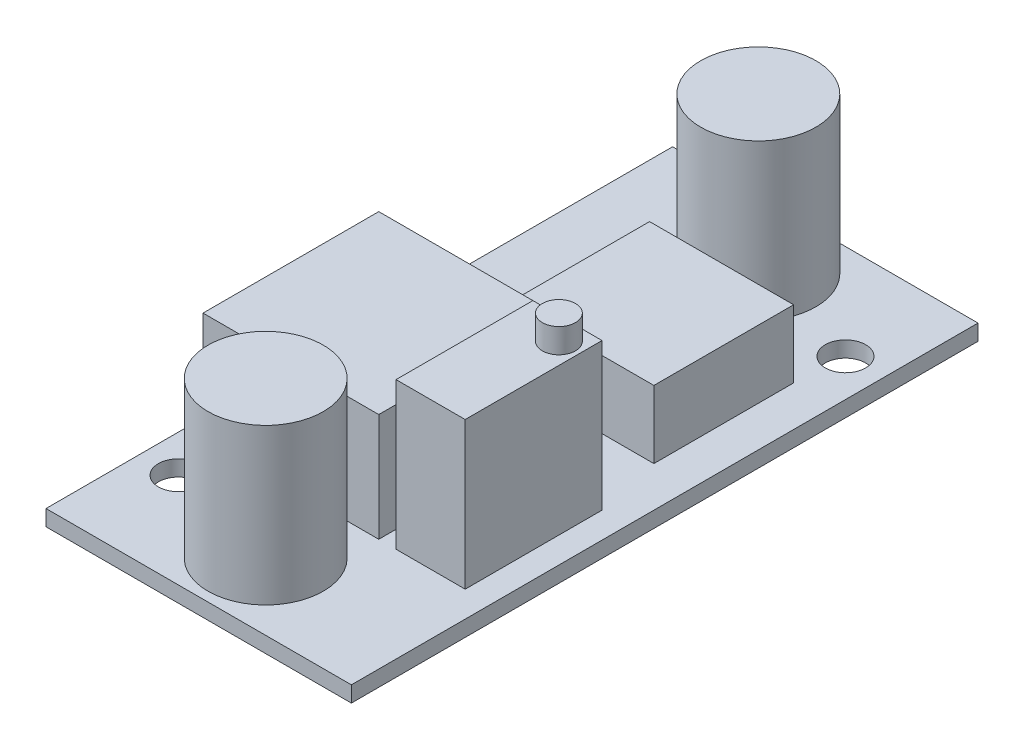
ISO-10303-21;
HEADER;
FILE_DESCRIPTION(('STEP AP214'),'2;1');
FILE_NAME('part.step','',(''),(''),'','','');
FILE_SCHEMA(('AUTOMOTIVE_DESIGN { 1 0 10303 214 1 1 1 1 }'));
ENDSEC;
DATA;
#1=APPLICATION_CONTEXT('core data for automotive mechanical design processes');
#2=APPLICATION_PROTOCOL_DEFINITION('international standard','automotive_design',2000,#1);
#3=PRODUCT_CONTEXT('',#1,'mechanical');
#4=PRODUCT('Part','Part','',(#3));
#5=PRODUCT_RELATED_PRODUCT_CATEGORY('part','',(#4));
#6=PRODUCT_DEFINITION_FORMATION('','',#4);
#7=PRODUCT_DEFINITION_CONTEXT('part definition',#1,'design');
#8=PRODUCT_DEFINITION('design','',#6,#7);
#9=PRODUCT_DEFINITION_SHAPE('','',#8);
#10=(LENGTH_UNIT() NAMED_UNIT(*) SI_UNIT(.MILLI.,.METRE.));
#11=(NAMED_UNIT(*) PLANE_ANGLE_UNIT() SI_UNIT($,.RADIAN.));
#12=(NAMED_UNIT(*) SI_UNIT($,.STERADIAN.) SOLID_ANGLE_UNIT());
#13=UNCERTAINTY_MEASURE_WITH_UNIT(LENGTH_MEASURE(1.E-05),#10,'distance_accuracy_value','');
#14=(GEOMETRIC_REPRESENTATION_CONTEXT(3) GLOBAL_UNCERTAINTY_ASSIGNED_CONTEXT((#13)) GLOBAL_UNIT_ASSIGNED_CONTEXT((#10,
#11,#12)) REPRESENTATION_CONTEXT('',''));
#15=CARTESIAN_POINT('',(0.,0.,0.));
#16=DIRECTION('',(0.,0.,1.));
#17=DIRECTION('',(1.,0.,0.));
#18=AXIS2_PLACEMENT_3D('',#15,#16,#17);
#19=CARTESIAN_POINT('',(0.,1.1,0.));
#20=DIRECTION('',(0.,1.,0.));
#21=DIRECTION('',(0.,0.,1.));
#22=AXIS2_PLACEMENT_3D('',#19,#20,#21);
#23=PLANE('',#22);
#24=CARTESIAN_POINT('',(-1.96202853894965E-12,1.1,17.1));
#25=DIRECTION('',(0.,1.,0.));
#26=DIRECTION('',(0.,0.,1.));
#27=AXIS2_PLACEMENT_3D('',#24,#25,#26);
#28=CIRCLE('',#27,4.);
#29=CARTESIAN_POINT('',(-1.96202853894965E-12,1.1,21.1));
#30=VERTEX_POINT('',#29);
#31=EDGE_CURVE('E234',#30,#30,#28,.T.);
#32=ORIENTED_EDGE('',*,*,#31,.F.);
#33=EDGE_LOOP('',(#32));
#34=FACE_BOUND('',#33,.T.);
#35=CARTESIAN_POINT('',(0.,1.1,-17.1));
#36=DIRECTION('',(0.,1.,0.));
#37=DIRECTION('',(0.,0.,1.));
#38=AXIS2_PLACEMENT_3D('',#35,#36,#37);
#39=CIRCLE('',#38,4.);
#40=CARTESIAN_POINT('',(0.,1.1,-13.1));
#41=VERTEX_POINT('',#40);
#42=EDGE_CURVE('E238',#41,#41,#39,.T.);
#43=ORIENTED_EDGE('',*,*,#42,.F.);
#44=EDGE_LOOP('',(#43));
#45=FACE_BOUND('',#44,.T.);
#46=CARTESIAN_POINT('',(8.,1.1,-15.15));
#47=DIRECTION('',(0.,1.,0.));
#48=DIRECTION('',(0.,0.,1.));
#49=AXIS2_PLACEMENT_3D('',#46,#47,#48);
#50=CIRCLE('',#49,1.4);
#51=CARTESIAN_POINT('',(8.,1.1,-13.75));
#52=VERTEX_POINT('',#51);
#53=EDGE_CURVE('E253',#52,#52,#50,.T.);
#54=ORIENTED_EDGE('',*,*,#53,.F.);
#55=EDGE_LOOP('',(#54));
#56=FACE_BOUND('',#55,.T.);
#57=DIRECTION('',(0.,0.,1.));
#58=VECTOR('',#57,1.);
#59=CARTESIAN_POINT('',(-10.6,1.1,21.75));
#60=LINE('',#59,#58);
#61=CARTESIAN_POINT('',(-10.6,1.1,-21.75));
#62=VERTEX_POINT('',#61);
#63=CARTESIAN_POINT('',(-10.6,1.1,21.75));
#64=VERTEX_POINT('',#63);
#65=EDGE_CURVE('E259',#62,#64,#60,.T.);
#66=ORIENTED_EDGE('',*,*,#65,.T.);
#67=DIRECTION('',(1.,0.,0.));
#68=VECTOR('',#67,1.);
#69=CARTESIAN_POINT('',(10.6,1.1,21.75));
#70=LINE('',#69,#68);
#71=CARTESIAN_POINT('',(10.6,1.1,21.75));
#72=VERTEX_POINT('',#71);
#73=EDGE_CURVE('E262',#64,#72,#70,.T.);
#74=ORIENTED_EDGE('',*,*,#73,.T.);
#75=DIRECTION('',(0.,0.,-1.));
#76=VECTOR('',#75,1.);
#77=CARTESIAN_POINT('',(10.6,1.1,21.75));
#78=LINE('',#77,#76);
#79=CARTESIAN_POINT('',(10.6,1.1,-21.75));
#80=VERTEX_POINT('',#79);
#81=EDGE_CURVE('E265',#72,#80,#78,.T.);
#82=ORIENTED_EDGE('',*,*,#81,.T.);
#83=DIRECTION('',(-1.,0.,0.));
#84=VECTOR('',#83,1.);
#85=CARTESIAN_POINT('',(10.6,1.1,-21.75));
#86=LINE('',#85,#84);
#87=EDGE_CURVE('E267',#80,#62,#86,.T.);
#88=ORIENTED_EDGE('',*,*,#87,.T.);
#89=EDGE_LOOP('',(#66,#74,#82,#88));
#90=FACE_BOUND('',#89,.T.);
#91=CARTESIAN_POINT('',(-8.0000000000001,1.1,15.1499999999999));
#92=DIRECTION('',(0.,1.,0.));
#93=DIRECTION('',(0.,0.,1.));
#94=AXIS2_PLACEMENT_3D('',#91,#92,#93);
#95=CIRCLE('',#94,1.4);
#96=CARTESIAN_POINT('',(-8.0000000000001,1.1,16.5499999999999));
#97=VERTEX_POINT('',#96);
#98=EDGE_CURVE('E247',#97,#97,#95,.T.);
#99=ORIENTED_EDGE('',*,*,#98,.F.);
#100=EDGE_LOOP('',(#99));
#101=FACE_BOUND('',#100,.T.);
#102=DIRECTION('',(-1.,0.,0.));
#103=VECTOR('',#102,1.);
#104=CARTESIAN_POINT('',(-9.4,1.1,-0.149999999999989));
#105=LINE('',#104,#103);
#106=CARTESIAN_POINT('',(2.8,1.1,-0.149999999999989));
#107=VERTEX_POINT('',#106);
#108=CARTESIAN_POINT('',(-9.4,1.1,-0.149999999999989));
#109=VERTEX_POINT('',#108);
#110=EDGE_CURVE('E219',#107,#109,#105,.T.);
#111=ORIENTED_EDGE('',*,*,#110,.F.);
#112=DIRECTION('',(0.,0.,-1.));
#113=VECTOR('',#112,1.);
#114=CARTESIAN_POINT('',(2.8,1.1,12.05));
#115=LINE('',#114,#113);
#116=CARTESIAN_POINT('',(2.8,1.1,12.05));
#117=VERTEX_POINT('',#116);
#118=EDGE_CURVE('E205',#117,#107,#115,.T.);
#119=ORIENTED_EDGE('',*,*,#118,.F.);
#120=DIRECTION('',(1.,0.,0.));
#121=VECTOR('',#120,1.);
#122=CARTESIAN_POINT('',(-9.4,1.1,12.05));
#123=LINE('',#122,#121);
#124=CARTESIAN_POINT('',(-9.4,1.1,12.05));
#125=VERTEX_POINT('',#124);
#126=EDGE_CURVE('E210',#125,#117,#123,.T.);
#127=ORIENTED_EDGE('',*,*,#126,.F.);
#128=DIRECTION('',(0.,0.,1.));
#129=VECTOR('',#128,1.);
#130=CARTESIAN_POINT('',(-9.4,1.1,12.05));
#131=LINE('',#130,#129);
#132=EDGE_CURVE('E221',#109,#125,#131,.T.);
#133=ORIENTED_EDGE('',*,*,#132,.F.);
#134=EDGE_LOOP('',(#111,#119,#127,#133));
#135=FACE_BOUND('',#134,.T.);
#136=DIRECTION('',(1.,0.,0.));
#137=VECTOR('',#136,1.);
#138=CARTESIAN_POINT('',(8.8,1.1,12.05));
#139=LINE('',#138,#137);
#140=CARTESIAN_POINT('',(4.00000000000001,1.1,12.05));
#141=VERTEX_POINT('',#140);
#142=CARTESIAN_POINT('',(8.8,1.1,12.05));
#143=VERTEX_POINT('',#142);
#144=EDGE_CURVE('E177',#141,#143,#139,.T.);
#145=ORIENTED_EDGE('',*,*,#144,.F.);
#146=DIRECTION('',(0.,0.,1.));
#147=VECTOR('',#146,1.);
#148=CARTESIAN_POINT('',(4.,1.1,2.55000000000001));
#149=LINE('',#148,#147);
#150=CARTESIAN_POINT('',(4.,1.1,2.55000000000001));
#151=VERTEX_POINT('',#150);
#152=EDGE_CURVE('E174',#151,#141,#149,.T.);
#153=ORIENTED_EDGE('',*,*,#152,.F.);
#154=DIRECTION('',(-1.,0.,0.));
#155=VECTOR('',#154,1.);
#156=CARTESIAN_POINT('',(8.8,1.1,2.55000000000001));
#157=LINE('',#156,#155);
#158=CARTESIAN_POINT('',(8.8,1.1,2.55000000000001));
#159=VERTEX_POINT('',#158);
#160=EDGE_CURVE('E186',#159,#151,#157,.T.);
#161=ORIENTED_EDGE('',*,*,#160,.F.);
#162=DIRECTION('',(0.,0.,-1.));
#163=VECTOR('',#162,1.);
#164=CARTESIAN_POINT('',(8.8,1.1,2.55000000000001));
#165=LINE('',#164,#163);
#166=EDGE_CURVE('E194',#143,#159,#165,.T.);
#167=ORIENTED_EDGE('',*,*,#166,.F.);
#168=EDGE_LOOP('',(#145,#153,#161,#167));
#169=FACE_BOUND('',#168,.T.);
#170=DIRECTION('',(-1.,0.,0.));
#171=VECTOR('',#170,1.);
#172=CARTESIAN_POINT('',(-2.2,1.1,-11.75));
#173=LINE('',#172,#171);
#174=CARTESIAN_POINT('',(7.8,1.1,-11.75));
#175=VERTEX_POINT('',#174);
#176=CARTESIAN_POINT('',(-2.2,1.1,-11.75));
#177=VERTEX_POINT('',#176);
#178=EDGE_CURVE('E321',#175,#177,#173,.T.);
#179=ORIENTED_EDGE('',*,*,#178,.F.);
#180=DIRECTION('',(0.,0.,-1.));
#181=VECTOR('',#180,1.);
#182=CARTESIAN_POINT('',(7.8,1.1,-11.75));
#183=LINE('',#182,#181);
#184=CARTESIAN_POINT('',(7.8,1.1,-2.04999999999999));
#185=VERTEX_POINT('',#184);
#186=EDGE_CURVE('E172',#185,#175,#183,.T.);
#187=ORIENTED_EDGE('',*,*,#186,.F.);
#188=DIRECTION('',(1.,0.,0.));
#189=VECTOR('',#188,1.);
#190=CARTESIAN_POINT('',(-2.2,1.1,-2.04999999999999));
#191=LINE('',#190,#189);
#192=CARTESIAN_POINT('',(-2.2,1.1,-2.04999999999999));
#193=VERTEX_POINT('',#192);
#194=EDGE_CURVE('E168',#193,#185,#191,.T.);
#195=ORIENTED_EDGE('',*,*,#194,.F.);
#196=DIRECTION('',(0.,0.,1.));
#197=VECTOR('',#196,1.);
#198=CARTESIAN_POINT('',(-2.2,1.1,-11.75));
#199=LINE('',#198,#197);
#200=EDGE_CURVE('E323',#177,#193,#199,.T.);
#201=ORIENTED_EDGE('',*,*,#200,.F.);
#202=EDGE_LOOP('',(#179,#187,#195,#201));
#203=FACE_BOUND('',#202,.T.);
#204=ADVANCED_FACE('F35',(#34,#45,#56,#90,#101,#135,#169,#203),#23,.T.);
#205=CARTESIAN_POINT('',(0.,0.,0.));
#206=DIRECTION('',(0.,1.,0.));
#207=DIRECTION('',(0.,0.,1.));
#208=AXIS2_PLACEMENT_3D('',#205,#206,#207);
#209=PLANE('',#208);
#210=DIRECTION('',(0.,0.,1.));
#211=VECTOR('',#210,1.);
#212=CARTESIAN_POINT('',(-10.6,0.,21.75));
#213=LINE('',#212,#211);
#214=CARTESIAN_POINT('',(-10.6,0.,-21.75));
#215=VERTEX_POINT('',#214);
#216=CARTESIAN_POINT('',(-10.6,0.,21.75));
#217=VERTEX_POINT('',#216);
#218=EDGE_CURVE('E256',#215,#217,#213,.T.);
#219=ORIENTED_EDGE('',*,*,#218,.F.);
#220=DIRECTION('',(-1.,0.,0.));
#221=VECTOR('',#220,1.);
#222=CARTESIAN_POINT('',(10.6,0.,-21.75));
#223=LINE('',#222,#221);
#224=CARTESIAN_POINT('',(10.6,0.,-21.75));
#225=VERTEX_POINT('',#224);
#226=EDGE_CURVE('E263',#225,#215,#223,.T.);
#227=ORIENTED_EDGE('',*,*,#226,.F.);
#228=DIRECTION('',(0.,0.,-1.));
#229=VECTOR('',#228,1.);
#230=CARTESIAN_POINT('',(10.6,0.,21.75));
#231=LINE('',#230,#229);
#232=CARTESIAN_POINT('',(10.6,0.,21.75));
#233=VERTEX_POINT('',#232);
#234=EDGE_CURVE('E274',#233,#225,#231,.T.);
#235=ORIENTED_EDGE('',*,*,#234,.F.);
#236=DIRECTION('',(1.,0.,0.));
#237=VECTOR('',#236,1.);
#238=CARTESIAN_POINT('',(10.6,0.,21.75));
#239=LINE('',#238,#237);
#240=EDGE_CURVE('E272',#217,#233,#239,.T.);
#241=ORIENTED_EDGE('',*,*,#240,.F.);
#242=EDGE_LOOP('',(#219,#227,#235,#241));
#243=FACE_BOUND('',#242,.T.);
#244=CARTESIAN_POINT('',(8.,0.,-15.15));
#245=DIRECTION('',(0.,1.,0.));
#246=DIRECTION('',(0.,0.,1.));
#247=AXIS2_PLACEMENT_3D('',#244,#245,#246);
#248=CIRCLE('',#247,1.4);
#249=CARTESIAN_POINT('',(8.,0.,-13.75));
#250=VERTEX_POINT('',#249);
#251=EDGE_CURVE('E250',#250,#250,#248,.T.);
#252=ORIENTED_EDGE('',*,*,#251,.T.);
#253=EDGE_LOOP('',(#252));
#254=FACE_BOUND('',#253,.T.);
#255=CARTESIAN_POINT('',(-8.0000000000001,0.,15.1499999999999));
#256=DIRECTION('',(0.,1.,0.));
#257=DIRECTION('',(0.,0.,1.));
#258=AXIS2_PLACEMENT_3D('',#255,#256,#257);
#259=CIRCLE('',#258,1.4);
#260=CARTESIAN_POINT('',(-8.0000000000001,0.,16.5499999999999));
#261=VERTEX_POINT('',#260);
#262=EDGE_CURVE('E244',#261,#261,#259,.T.);
#263=ORIENTED_EDGE('',*,*,#262,.T.);
#264=EDGE_LOOP('',(#263));
#265=FACE_BOUND('',#264,.T.);
#266=ADVANCED_FACE('F295',(#243,#254,#265),#209,.F.);
#267=CARTESIAN_POINT('',(-10.6,1.1,21.75));
#268=DIRECTION('',(1.,0.,0.));
#269=DIRECTION('',(0.,0.,-1.));
#270=AXIS2_PLACEMENT_3D('',#267,#268,#269);
#271=PLANE('',#270);
#272=ORIENTED_EDGE('',*,*,#218,.T.);
#273=DIRECTION('',(0.,-1.,0.));
#274=VECTOR('',#273,1.);
#275=CARTESIAN_POINT('',(-10.6,1.1,21.75));
#276=LINE('',#275,#274);
#277=EDGE_CURVE('E43',#64,#217,#276,.T.);
#278=ORIENTED_EDGE('',*,*,#277,.F.);
#279=ORIENTED_EDGE('',*,*,#65,.F.);
#280=DIRECTION('',(0.,-1.,0.));
#281=VECTOR('',#280,1.);
#282=CARTESIAN_POINT('',(-10.6,1.1,-21.75));
#283=LINE('',#282,#281);
#284=EDGE_CURVE('E269',#62,#215,#283,.T.);
#285=ORIENTED_EDGE('',*,*,#284,.T.);
#286=EDGE_LOOP('',(#272,#278,#279,#285));
#287=FACE_BOUND('',#286,.T.);
#288=ADVANCED_FACE('F37',(#287),#271,.F.);
#289=CARTESIAN_POINT('',(10.6,1.1,21.75));
#290=DIRECTION('',(0.,0.,-1.));
#291=DIRECTION('',(-1.,0.,0.));
#292=AXIS2_PLACEMENT_3D('',#289,#290,#291);
#293=PLANE('',#292);
#294=ORIENTED_EDGE('',*,*,#240,.T.);
#295=DIRECTION('',(0.,-1.,0.));
#296=VECTOR('',#295,1.);
#297=CARTESIAN_POINT('',(10.6,1.1,21.75));
#298=LINE('',#297,#296);
#299=EDGE_CURVE('E282',#72,#233,#298,.T.);
#300=ORIENTED_EDGE('',*,*,#299,.F.);
#301=ORIENTED_EDGE('',*,*,#73,.F.);
#302=ORIENTED_EDGE('',*,*,#277,.T.);
#303=EDGE_LOOP('',(#294,#300,#301,#302));
#304=FACE_BOUND('',#303,.T.);
#305=ADVANCED_FACE('F287',(#304),#293,.F.);
#306=CARTESIAN_POINT('',(10.6,1.1,21.75));
#307=DIRECTION('',(-1.,0.,0.));
#308=DIRECTION('',(0.,0.,1.));
#309=AXIS2_PLACEMENT_3D('',#306,#307,#308);
#310=PLANE('',#309);
#311=ORIENTED_EDGE('',*,*,#234,.T.);
#312=DIRECTION('',(0.,-1.,0.));
#313=VECTOR('',#312,1.);
#314=CARTESIAN_POINT('',(10.6,1.1,-21.75));
#315=LINE('',#314,#313);
#316=EDGE_CURVE('E279',#80,#225,#315,.T.);
#317=ORIENTED_EDGE('',*,*,#316,.F.);
#318=ORIENTED_EDGE('',*,*,#81,.F.);
#319=ORIENTED_EDGE('',*,*,#299,.T.);
#320=EDGE_LOOP('',(#311,#317,#318,#319));
#321=FACE_BOUND('',#320,.T.);
#322=ADVANCED_FACE('F300',(#321),#310,.F.);
#323=CARTESIAN_POINT('',(10.6,1.1,-21.75));
#324=DIRECTION('',(0.,0.,1.));
#325=DIRECTION('',(1.,0.,0.));
#326=AXIS2_PLACEMENT_3D('',#323,#324,#325);
#327=PLANE('',#326);
#328=ORIENTED_EDGE('',*,*,#226,.T.);
#329=ORIENTED_EDGE('',*,*,#284,.F.);
#330=ORIENTED_EDGE('',*,*,#87,.F.);
#331=ORIENTED_EDGE('',*,*,#316,.T.);
#332=EDGE_LOOP('',(#328,#329,#330,#331));
#333=FACE_BOUND('',#332,.T.);
#334=ADVANCED_FACE('F304',(#333),#327,.F.);
#335=CARTESIAN_POINT('',(8.,1.1,-15.15));
#336=DIRECTION('',(0.,-1.,0.));
#337=DIRECTION('',(0.,0.,-1.));
#338=AXIS2_PLACEMENT_3D('',#335,#336,#337);
#339=CYLINDRICAL_SURFACE('',#338,1.4);
#340=ORIENTED_EDGE('',*,*,#53,.T.);
#341=EDGE_LOOP('',(#340));
#342=FACE_BOUND('',#341,.T.);
#343=ORIENTED_EDGE('',*,*,#251,.F.);
#344=EDGE_LOOP('',(#343));
#345=FACE_BOUND('',#344,.T.);
#346=ADVANCED_FACE('F413',(#342,#345),#339,.F.);
#347=CARTESIAN_POINT('',(-8.0000000000001,1.1,15.1499999999999));
#348=DIRECTION('',(0.,-1.,0.));
#349=DIRECTION('',(0.,0.,-1.));
#350=AXIS2_PLACEMENT_3D('',#347,#348,#349);
#351=CYLINDRICAL_SURFACE('',#350,1.4);
#352=ORIENTED_EDGE('',*,*,#98,.T.);
#353=EDGE_LOOP('',(#352));
#354=FACE_BOUND('',#353,.T.);
#355=ORIENTED_EDGE('',*,*,#262,.F.);
#356=EDGE_LOOP('',(#355));
#357=FACE_BOUND('',#356,.T.);
#358=ADVANCED_FACE('F409',(#354,#357),#351,.F.);
#359=CARTESIAN_POINT('',(0.,11.9,-17.1));
#360=DIRECTION('',(0.,-1.,0.));
#361=DIRECTION('',(0.,0.,-1.));
#362=AXIS2_PLACEMENT_3D('',#359,#360,#361);
#363=CYLINDRICAL_SURFACE('',#362,4.);
#364=CARTESIAN_POINT('',(0.,11.9,-17.1));
#365=DIRECTION('',(0.,1.,0.));
#366=DIRECTION('',(0.,0.,1.));
#367=AXIS2_PLACEMENT_3D('',#364,#365,#366);
#368=CIRCLE('',#367,4.);
#369=CARTESIAN_POINT('',(0.,11.9,-13.1));
#370=VERTEX_POINT('',#369);
#371=EDGE_CURVE('E241',#370,#370,#368,.T.);
#372=ORIENTED_EDGE('',*,*,#371,.F.);
#373=EDGE_LOOP('',(#372));
#374=FACE_BOUND('',#373,.T.);
#375=ORIENTED_EDGE('',*,*,#42,.T.);
#376=EDGE_LOOP('',(#375));
#377=FACE_BOUND('',#376,.T.);
#378=ADVANCED_FACE('F405',(#374,#377),#363,.T.);
#379=CARTESIAN_POINT('',(0.,11.9,-17.1));
#380=DIRECTION('',(0.,1.,0.));
#381=DIRECTION('',(0.,0.,1.));
#382=AXIS2_PLACEMENT_3D('',#379,#380,#381);
#383=PLANE('',#382);
#384=ORIENTED_EDGE('',*,*,#371,.T.);
#385=EDGE_LOOP('',(#384));
#386=FACE_BOUND('',#385,.T.);
#387=ADVANCED_FACE('F401',(#386),#383,.T.);
#388=CARTESIAN_POINT('',(-1.96202853894965E-12,11.9,17.1));
#389=DIRECTION('',(0.,-1.,0.));
#390=DIRECTION('',(0.,0.,-1.));
#391=AXIS2_PLACEMENT_3D('',#388,#389,#390);
#392=CYLINDRICAL_SURFACE('',#391,4.);
#393=CARTESIAN_POINT('',(-1.96202853894965E-12,11.9,17.1));
#394=DIRECTION('',(0.,1.,0.));
#395=DIRECTION('',(0.,0.,1.));
#396=AXIS2_PLACEMENT_3D('',#393,#394,#395);
#397=CIRCLE('',#396,4.);
#398=CARTESIAN_POINT('',(-1.96202853894965E-12,11.9,21.1));
#399=VERTEX_POINT('',#398);
#400=EDGE_CURVE('E235',#399,#399,#397,.T.);
#401=ORIENTED_EDGE('',*,*,#400,.F.);
#402=EDGE_LOOP('',(#401));
#403=FACE_BOUND('',#402,.T.);
#404=ORIENTED_EDGE('',*,*,#31,.T.);
#405=EDGE_LOOP('',(#404));
#406=FACE_BOUND('',#405,.T.);
#407=ADVANCED_FACE('F397',(#403,#406),#392,.T.);
#408=CARTESIAN_POINT('',(-1.96202853894965E-12,11.9,17.1));
#409=DIRECTION('',(0.,1.,0.));
#410=DIRECTION('',(0.,0.,1.));
#411=AXIS2_PLACEMENT_3D('',#408,#409,#410);
#412=PLANE('',#411);
#413=ORIENTED_EDGE('',*,*,#400,.T.);
#414=EDGE_LOOP('',(#413));
#415=FACE_BOUND('',#414,.T.);
#416=ADVANCED_FACE('F393',(#415),#412,.T.);
#417=CARTESIAN_POINT('',(2.8,8.6,12.05));
#418=DIRECTION('',(-1.,0.,0.));
#419=DIRECTION('',(0.,0.,1.));
#420=AXIS2_PLACEMENT_3D('',#417,#418,#419);
#421=PLANE('',#420);
#422=ORIENTED_EDGE('',*,*,#118,.T.);
#423=DIRECTION('',(0.,-1.,0.));
#424=VECTOR('',#423,1.);
#425=CARTESIAN_POINT('',(2.8,8.6,-0.149999999999989));
#426=LINE('',#425,#424);
#427=CARTESIAN_POINT('',(2.8,8.6,-0.149999999999989));
#428=VERTEX_POINT('',#427);
#429=EDGE_CURVE('E232',#428,#107,#426,.T.);
#430=ORIENTED_EDGE('',*,*,#429,.F.);
#431=DIRECTION('',(0.,0.,-1.));
#432=VECTOR('',#431,1.);
#433=CARTESIAN_POINT('',(2.8,8.6,12.05));
#434=LINE('',#433,#432);
#435=CARTESIAN_POINT('',(2.8,8.6,12.05));
#436=VERTEX_POINT('',#435);
#437=EDGE_CURVE('E206',#436,#428,#434,.T.);
#438=ORIENTED_EDGE('',*,*,#437,.F.);
#439=DIRECTION('',(0.,-1.,0.));
#440=VECTOR('',#439,1.);
#441=CARTESIAN_POINT('',(2.8,8.6,12.05));
#442=LINE('',#441,#440);
#443=EDGE_CURVE('E216',#436,#117,#442,.T.);
#444=ORIENTED_EDGE('',*,*,#443,.T.);
#445=EDGE_LOOP('',(#422,#430,#438,#444));
#446=FACE_BOUND('',#445,.T.);
#447=ADVANCED_FACE('F389',(#446),#421,.F.);
#448=CARTESIAN_POINT('',(-9.4,8.6,-0.149999999999989));
#449=DIRECTION('',(0.,0.,1.));
#450=DIRECTION('',(1.,0.,0.));
#451=AXIS2_PLACEMENT_3D('',#448,#449,#450);
#452=PLANE('',#451);
#453=ORIENTED_EDGE('',*,*,#110,.T.);
#454=DIRECTION('',(0.,-1.,0.));
#455=VECTOR('',#454,1.);
#456=CARTESIAN_POINT('',(-9.4,8.6,-0.149999999999989));
#457=LINE('',#456,#455);
#458=CARTESIAN_POINT('',(-9.4,8.6,-0.149999999999989));
#459=VERTEX_POINT('',#458);
#460=EDGE_CURVE('E229',#459,#109,#457,.T.);
#461=ORIENTED_EDGE('',*,*,#460,.F.);
#462=DIRECTION('',(-1.,0.,0.));
#463=VECTOR('',#462,1.);
#464=CARTESIAN_POINT('',(-9.4,8.6,-0.149999999999989));
#465=LINE('',#464,#463);
#466=EDGE_CURVE('E209',#428,#459,#465,.T.);
#467=ORIENTED_EDGE('',*,*,#466,.F.);
#468=ORIENTED_EDGE('',*,*,#429,.T.);
#469=EDGE_LOOP('',(#453,#461,#467,#468));
#470=FACE_BOUND('',#469,.T.);
#471=ADVANCED_FACE('F385',(#470),#452,.F.);
#472=CARTESIAN_POINT('',(-9.4,8.6,12.05));
#473=DIRECTION('',(1.,0.,0.));
#474=DIRECTION('',(0.,0.,-1.));
#475=AXIS2_PLACEMENT_3D('',#472,#473,#474);
#476=PLANE('',#475);
#477=ORIENTED_EDGE('',*,*,#132,.T.);
#478=DIRECTION('',(0.,-1.,0.));
#479=VECTOR('',#478,1.);
#480=CARTESIAN_POINT('',(-9.4,8.6,12.05));
#481=LINE('',#480,#479);
#482=CARTESIAN_POINT('',(-9.4,8.6,12.05));
#483=VERTEX_POINT('',#482);
#484=EDGE_CURVE('E227',#483,#125,#481,.T.);
#485=ORIENTED_EDGE('',*,*,#484,.F.);
#486=DIRECTION('',(0.,0.,1.));
#487=VECTOR('',#486,1.);
#488=CARTESIAN_POINT('',(-9.4,8.6,12.05));
#489=LINE('',#488,#487);
#490=EDGE_CURVE('E212',#459,#483,#489,.T.);
#491=ORIENTED_EDGE('',*,*,#490,.F.);
#492=ORIENTED_EDGE('',*,*,#460,.T.);
#493=EDGE_LOOP('',(#477,#485,#491,#492));
#494=FACE_BOUND('',#493,.T.);
#495=ADVANCED_FACE('F381',(#494),#476,.F.);
#496=CARTESIAN_POINT('',(-9.4,8.6,12.05));
#497=DIRECTION('',(0.,0.,-1.));
#498=DIRECTION('',(-1.,0.,0.));
#499=AXIS2_PLACEMENT_3D('',#496,#497,#498);
#500=PLANE('',#499);
#501=ORIENTED_EDGE('',*,*,#126,.T.);
#502=ORIENTED_EDGE('',*,*,#443,.F.);
#503=DIRECTION('',(1.,0.,0.));
#504=VECTOR('',#503,1.);
#505=CARTESIAN_POINT('',(-9.4,8.6,12.05));
#506=LINE('',#505,#504);
#507=EDGE_CURVE('E214',#483,#436,#506,.T.);
#508=ORIENTED_EDGE('',*,*,#507,.F.);
#509=ORIENTED_EDGE('',*,*,#484,.T.);
#510=EDGE_LOOP('',(#501,#502,#508,#509));
#511=FACE_BOUND('',#510,.T.);
#512=ADVANCED_FACE('F377',(#511),#500,.F.);
#513=CARTESIAN_POINT('',(0.,8.6,0.));
#514=DIRECTION('',(0.,-1.,0.));
#515=DIRECTION('',(0.,0.,-1.));
#516=AXIS2_PLACEMENT_3D('',#513,#514,#515);
#517=PLANE('',#516);
#518=ORIENTED_EDGE('',*,*,#437,.T.);
#519=ORIENTED_EDGE('',*,*,#466,.T.);
#520=ORIENTED_EDGE('',*,*,#490,.T.);
#521=ORIENTED_EDGE('',*,*,#507,.T.);
#522=EDGE_LOOP('',(#518,#519,#520,#521));
#523=FACE_BOUND('',#522,.T.);
#524=ADVANCED_FACE('F374',(#523),#517,.F.);
#525=CARTESIAN_POINT('',(4.,11.3,2.55000000000001));
#526=DIRECTION('',(1.,0.,0.));
#527=DIRECTION('',(0.,0.,-1.));
#528=AXIS2_PLACEMENT_3D('',#525,#526,#527);
#529=PLANE('',#528);
#530=ORIENTED_EDGE('',*,*,#152,.T.);
#531=DIRECTION('',(0.,-1.,0.));
#532=VECTOR('',#531,1.);
#533=CARTESIAN_POINT('',(4.00000000000001,11.3,12.05));
#534=LINE('',#533,#532);
#535=CARTESIAN_POINT('',(4.00000000000001,11.3,12.05));
#536=VERTEX_POINT('',#535);
#537=EDGE_CURVE('E203',#536,#141,#534,.T.);
#538=ORIENTED_EDGE('',*,*,#537,.F.);
#539=DIRECTION('',(0.,0.,1.));
#540=VECTOR('',#539,1.);
#541=CARTESIAN_POINT('',(4.,11.3,2.55000000000001));
#542=LINE('',#541,#540);
#543=CARTESIAN_POINT('',(4.,11.3,2.55000000000001));
#544=VERTEX_POINT('',#543);
#545=EDGE_CURVE('E182',#544,#536,#542,.T.);
#546=ORIENTED_EDGE('',*,*,#545,.F.);
#547=DIRECTION('',(0.,-1.,0.));
#548=VECTOR('',#547,1.);
#549=CARTESIAN_POINT('',(4.,11.3,2.55000000000001));
#550=LINE('',#549,#548);
#551=EDGE_CURVE('E191',#544,#151,#550,.T.);
#552=ORIENTED_EDGE('',*,*,#551,.T.);
#553=EDGE_LOOP('',(#530,#538,#546,#552));
#554=FACE_BOUND('',#553,.T.);
#555=ADVANCED_FACE('F355',(#554),#529,.F.);
#556=CARTESIAN_POINT('',(8.8,11.3,12.05));
#557=DIRECTION('',(0.,0.,-1.));
#558=DIRECTION('',(-1.,0.,0.));
#559=AXIS2_PLACEMENT_3D('',#556,#557,#558);
#560=PLANE('',#559);
#561=ORIENTED_EDGE('',*,*,#144,.T.);
#562=DIRECTION('',(0.,-1.,0.));
#563=VECTOR('',#562,1.);
#564=CARTESIAN_POINT('',(8.8,11.3,12.05));
#565=LINE('',#564,#563);
#566=CARTESIAN_POINT('',(8.8,11.3,12.05));
#567=VERTEX_POINT('',#566);
#568=EDGE_CURVE('E200',#567,#143,#565,.T.);
#569=ORIENTED_EDGE('',*,*,#568,.F.);
#570=DIRECTION('',(1.,0.,0.));
#571=VECTOR('',#570,1.);
#572=CARTESIAN_POINT('',(8.8,11.3,12.05));
#573=LINE('',#572,#571);
#574=EDGE_CURVE('E185',#536,#567,#573,.T.);
#575=ORIENTED_EDGE('',*,*,#574,.F.);
#576=ORIENTED_EDGE('',*,*,#537,.T.);
#577=EDGE_LOOP('',(#561,#569,#575,#576));
#578=FACE_BOUND('',#577,.T.);
#579=ADVANCED_FACE('F357',(#578),#560,.F.);
#580=CARTESIAN_POINT('',(8.8,11.3,2.55000000000001));
#581=DIRECTION('',(-1.,0.,0.));
#582=DIRECTION('',(0.,0.,1.));
#583=AXIS2_PLACEMENT_3D('',#580,#581,#582);
#584=PLANE('',#583);
#585=ORIENTED_EDGE('',*,*,#166,.T.);
#586=DIRECTION('',(0.,-1.,0.));
#587=VECTOR('',#586,1.);
#588=CARTESIAN_POINT('',(8.8,11.3,2.55000000000001));
#589=LINE('',#588,#587);
#590=CARTESIAN_POINT('',(8.8,11.3,2.55000000000001));
#591=VERTEX_POINT('',#590);
#592=EDGE_CURVE('E58',#591,#159,#589,.T.);
#593=ORIENTED_EDGE('',*,*,#592,.F.);
#594=DIRECTION('',(0.,0.,-1.));
#595=VECTOR('',#594,1.);
#596=CARTESIAN_POINT('',(8.8,11.3,2.55000000000001));
#597=LINE('',#596,#595);
#598=EDGE_CURVE('E188',#567,#591,#597,.T.);
#599=ORIENTED_EDGE('',*,*,#598,.F.);
#600=ORIENTED_EDGE('',*,*,#568,.T.);
#601=EDGE_LOOP('',(#585,#593,#599,#600));
#602=FACE_BOUND('',#601,.T.);
#603=ADVANCED_FACE('F360',(#602),#584,.F.);
#604=CARTESIAN_POINT('',(8.8,11.3,2.55000000000001));
#605=DIRECTION('',(0.,0.,1.));
#606=DIRECTION('',(1.,0.,0.));
#607=AXIS2_PLACEMENT_3D('',#604,#605,#606);
#608=PLANE('',#607);
#609=ORIENTED_EDGE('',*,*,#160,.T.);
#610=ORIENTED_EDGE('',*,*,#551,.F.);
#611=DIRECTION('',(-1.,0.,0.));
#612=VECTOR('',#611,1.);
#613=CARTESIAN_POINT('',(8.8,11.3,2.55000000000001));
#614=LINE('',#613,#612);
#615=EDGE_CURVE('E190',#591,#544,#614,.T.);
#616=ORIENTED_EDGE('',*,*,#615,.F.);
#617=ORIENTED_EDGE('',*,*,#592,.T.);
#618=EDGE_LOOP('',(#609,#610,#616,#617));
#619=FACE_BOUND('',#618,.T.);
#620=ADVANCED_FACE('F348',(#619),#608,.F.);
#621=CARTESIAN_POINT('',(0.,11.3,0.));
#622=DIRECTION('',(0.,-1.,0.));
#623=DIRECTION('',(0.,0.,-1.));
#624=AXIS2_PLACEMENT_3D('',#621,#622,#623);
#625=PLANE('',#624);
#626=CARTESIAN_POINT('',(7.35166232936635,11.3,4.0960395318308));
#627=DIRECTION('',(0.,-1.,0.));
#628=DIRECTION('',(0.,0.,-1.));
#629=AXIS2_PLACEMENT_3D('',#626,#627,#628);
#630=CIRCLE('',#629,1.15);
#631=CARTESIAN_POINT('',(7.35166232936635,11.3,2.9460395318308));
#632=VERTEX_POINT('',#631);
#633=EDGE_CURVE('E11',#632,#632,#630,.F.);
#634=ORIENTED_EDGE('',*,*,#633,.F.);
#635=EDGE_LOOP('',(#634));
#636=FACE_BOUND('',#635,.T.);
#637=ORIENTED_EDGE('',*,*,#545,.T.);
#638=ORIENTED_EDGE('',*,*,#574,.T.);
#639=ORIENTED_EDGE('',*,*,#598,.T.);
#640=ORIENTED_EDGE('',*,*,#615,.T.);
#641=EDGE_LOOP('',(#637,#638,#639,#640));
#642=FACE_BOUND('',#641,.T.);
#643=ADVANCED_FACE('F345',(#636,#642),#625,.F.);
#644=CARTESIAN_POINT('',(7.8,5.8,-11.75));
#645=DIRECTION('',(-1.,0.,0.));
#646=DIRECTION('',(0.,0.,1.));
#647=AXIS2_PLACEMENT_3D('',#644,#645,#646);
#648=PLANE('',#647);
#649=ORIENTED_EDGE('',*,*,#186,.T.);
#650=DIRECTION('',(0.,-1.,0.));
#651=VECTOR('',#650,1.);
#652=CARTESIAN_POINT('',(7.8,5.8,-11.75));
#653=LINE('',#652,#651);
#654=CARTESIAN_POINT('',(7.8,5.8,-11.75));
#655=VERTEX_POINT('',#654);
#656=EDGE_CURVE('E153',#655,#175,#653,.T.);
#657=ORIENTED_EDGE('',*,*,#656,.F.);
#658=DIRECTION('',(0.,0.,-1.));
#659=VECTOR('',#658,1.);
#660=CARTESIAN_POINT('',(7.8,5.8,-11.75));
#661=LINE('',#660,#659);
#662=CARTESIAN_POINT('',(7.8,5.8,-2.04999999999999));
#663=VERTEX_POINT('',#662);
#664=EDGE_CURVE('E160',#663,#655,#661,.T.);
#665=ORIENTED_EDGE('',*,*,#664,.F.);
#666=DIRECTION('',(0.,-1.,0.));
#667=VECTOR('',#666,1.);
#668=CARTESIAN_POINT('',(7.8,5.8,-2.04999999999999));
#669=LINE('',#668,#667);
#670=EDGE_CURVE('E331',#663,#185,#669,.T.);
#671=ORIENTED_EDGE('',*,*,#670,.T.);
#672=EDGE_LOOP('',(#649,#657,#665,#671));
#673=FACE_BOUND('',#672,.T.);
#674=ADVANCED_FACE('F170',(#673),#648,.F.);
#675=CARTESIAN_POINT('',(-2.2,5.8,-11.75));
#676=DIRECTION('',(0.,0.,1.));
#677=DIRECTION('',(1.,0.,0.));
#678=AXIS2_PLACEMENT_3D('',#675,#676,#677);
#679=PLANE('',#678);
#680=ORIENTED_EDGE('',*,*,#178,.T.);
#681=DIRECTION('',(0.,-1.,0.));
#682=VECTOR('',#681,1.);
#683=CARTESIAN_POINT('',(-2.2,5.8,-11.75));
#684=LINE('',#683,#682);
#685=CARTESIAN_POINT('',(-2.2,5.8,-11.75));
#686=VERTEX_POINT('',#685);
#687=EDGE_CURVE('E156',#686,#177,#684,.T.);
#688=ORIENTED_EDGE('',*,*,#687,.F.);
#689=DIRECTION('',(-1.,0.,0.));
#690=VECTOR('',#689,1.);
#691=CARTESIAN_POINT('',(-2.2,5.8,-11.75));
#692=LINE('',#691,#690);
#693=EDGE_CURVE('E149',#655,#686,#692,.T.);
#694=ORIENTED_EDGE('',*,*,#693,.F.);
#695=ORIENTED_EDGE('',*,*,#656,.T.);
#696=EDGE_LOOP('',(#680,#688,#694,#695));
#697=FACE_BOUND('',#696,.T.);
#698=ADVANCED_FACE('F151',(#697),#679,.F.);
#699=CARTESIAN_POINT('',(-2.2,5.8,-11.75));
#700=DIRECTION('',(1.,0.,0.));
#701=DIRECTION('',(0.,0.,-1.));
#702=AXIS2_PLACEMENT_3D('',#699,#700,#701);
#703=PLANE('',#702);
#704=ORIENTED_EDGE('',*,*,#200,.T.);
#705=DIRECTION('',(0.,-1.,0.));
#706=VECTOR('',#705,1.);
#707=CARTESIAN_POINT('',(-2.2,5.8,-2.04999999999999));
#708=LINE('',#707,#706);
#709=CARTESIAN_POINT('',(-2.2,5.8,-2.04999999999999));
#710=VERTEX_POINT('',#709);
#711=EDGE_CURVE('E50',#710,#193,#708,.T.);
#712=ORIENTED_EDGE('',*,*,#711,.F.);
#713=DIRECTION('',(0.,0.,1.));
#714=VECTOR('',#713,1.);
#715=CARTESIAN_POINT('',(-2.2,5.8,-11.75));
#716=LINE('',#715,#714);
#717=EDGE_CURVE('E159',#686,#710,#716,.T.);
#718=ORIENTED_EDGE('',*,*,#717,.F.);
#719=ORIENTED_EDGE('',*,*,#687,.T.);
#720=EDGE_LOOP('',(#704,#712,#718,#719));
#721=FACE_BOUND('',#720,.T.);
#722=ADVANCED_FACE('F457',(#721),#703,.F.);
#723=CARTESIAN_POINT('',(-2.2,5.8,-2.04999999999999));
#724=DIRECTION('',(0.,0.,-1.));
#725=DIRECTION('',(-1.,0.,0.));
#726=AXIS2_PLACEMENT_3D('',#723,#724,#725);
#727=PLANE('',#726);
#728=ORIENTED_EDGE('',*,*,#194,.T.);
#729=ORIENTED_EDGE('',*,*,#670,.F.);
#730=DIRECTION('',(1.,0.,0.));
#731=VECTOR('',#730,1.);
#732=CARTESIAN_POINT('',(-2.2,5.8,-2.04999999999999));
#733=LINE('',#732,#731);
#734=EDGE_CURVE('E164',#710,#663,#733,.T.);
#735=ORIENTED_EDGE('',*,*,#734,.F.);
#736=ORIENTED_EDGE('',*,*,#711,.T.);
#737=EDGE_LOOP('',(#728,#729,#735,#736));
#738=FACE_BOUND('',#737,.T.);
#739=ADVANCED_FACE('F466',(#738),#727,.F.);
#740=CARTESIAN_POINT('',(0.,5.8,0.));
#741=DIRECTION('',(0.,1.,0.));
#742=DIRECTION('',(0.,0.,1.));
#743=AXIS2_PLACEMENT_3D('',#740,#741,#742);
#744=PLANE('',#743);
#745=ORIENTED_EDGE('',*,*,#664,.T.);
#746=ORIENTED_EDGE('',*,*,#693,.T.);
#747=ORIENTED_EDGE('',*,*,#717,.T.);
#748=ORIENTED_EDGE('',*,*,#734,.T.);
#749=EDGE_LOOP('',(#745,#746,#747,#748));
#750=FACE_BOUND('',#749,.T.);
#751=ADVANCED_FACE('F163',(#750),#744,.T.);
#752=CARTESIAN_POINT('',(7.35166232936635,13.,4.0960395318308));
#753=DIRECTION('',(0.,-1.,0.));
#754=DIRECTION('',(0.,0.,-1.));
#755=AXIS2_PLACEMENT_3D('',#752,#753,#754);
#756=CYLINDRICAL_SURFACE('',#755,1.15);
#757=CARTESIAN_POINT('',(7.35166232936635,13.,4.0960395318308));
#758=DIRECTION('',(0.,1.,0.));
#759=DIRECTION('',(0.,0.,1.));
#760=AXIS2_PLACEMENT_3D('',#757,#758,#759);
#761=CIRCLE('',#760,1.15);
#762=CARTESIAN_POINT('',(7.35166232936635,13.,5.2460395318308));
#763=VERTEX_POINT('',#762);
#764=EDGE_CURVE('E326',#763,#763,#761,.T.);
#765=ORIENTED_EDGE('',*,*,#764,.F.);
#766=EDGE_LOOP('',(#765));
#767=FACE_BOUND('',#766,.T.);
#768=ORIENTED_EDGE('',*,*,#633,.T.);
#769=EDGE_LOOP('',(#768));
#770=FACE_BOUND('',#769,.T.);
#771=ADVANCED_FACE('F339',(#767,#770),#756,.T.);
#772=CARTESIAN_POINT('',(7.35166232936635,13.,4.0960395318308));
#773=DIRECTION('',(0.,1.,0.));
#774=DIRECTION('',(0.,0.,1.));
#775=AXIS2_PLACEMENT_3D('',#772,#773,#774);
#776=PLANE('',#775);
#777=ORIENTED_EDGE('',*,*,#764,.T.);
#778=EDGE_LOOP('',(#777));
#779=FACE_BOUND('',#778,.T.);
#780=ADVANCED_FACE('F337',(#779),#776,.T.);
#781=CLOSED_SHELL('',(#204,#266,#288,#305,#322,#334,#346,#358,#378,#387,#407,#416,#447,#471,
#495,#512,#524,#555,#579,#603,#620,#643,#674,#698,#722,#739,#751,#771,#780));
#782=MANIFOLD_SOLID_BREP('B2',#781);
#783=ADVANCED_BREP_SHAPE_REPRESENTATION('',(#18,#782),#14);
#784=SHAPE_DEFINITION_REPRESENTATION(#9,#783);
ENDSEC;
END-ISO-10303-21;
